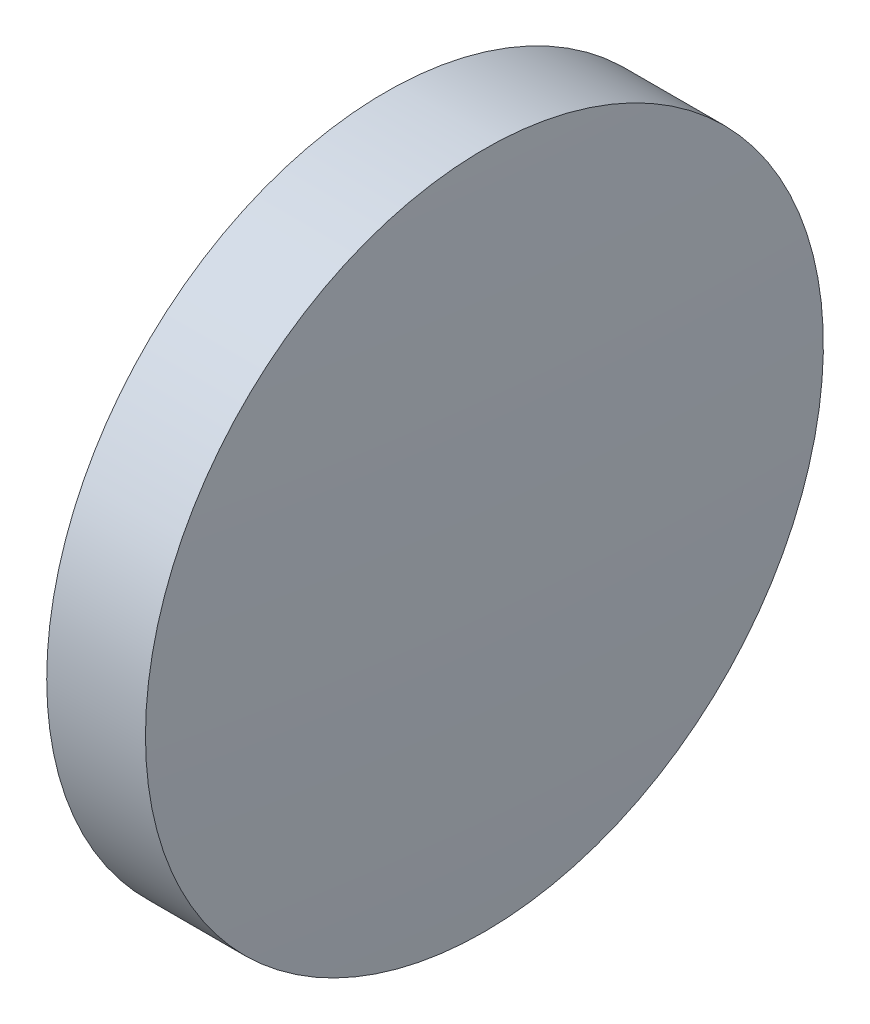
ISO-10303-21;
HEADER;
FILE_DESCRIPTION(('STEP AP214'),'2;1');
FILE_NAME('part.step','',(''),(''),'','','');
FILE_SCHEMA(('AUTOMOTIVE_DESIGN { 1 0 10303 214 1 1 1 1 }'));
ENDSEC;
DATA;
#1=APPLICATION_CONTEXT('core data for automotive mechanical design processes');
#2=APPLICATION_PROTOCOL_DEFINITION('international standard','automotive_design',2000,#1);
#3=PRODUCT_CONTEXT('',#1,'mechanical');
#4=PRODUCT('Part','Part','',(#3));
#5=PRODUCT_RELATED_PRODUCT_CATEGORY('part','',(#4));
#6=PRODUCT_DEFINITION_FORMATION('','',#4);
#7=PRODUCT_DEFINITION_CONTEXT('part definition',#1,'design');
#8=PRODUCT_DEFINITION('design','',#6,#7);
#9=PRODUCT_DEFINITION_SHAPE('','',#8);
#10=(LENGTH_UNIT() NAMED_UNIT(*) SI_UNIT(.MILLI.,.METRE.));
#11=(NAMED_UNIT(*) PLANE_ANGLE_UNIT() SI_UNIT($,.RADIAN.));
#12=(NAMED_UNIT(*) SI_UNIT($,.STERADIAN.) SOLID_ANGLE_UNIT());
#13=UNCERTAINTY_MEASURE_WITH_UNIT(LENGTH_MEASURE(1.E-05),#10,'distance_accuracy_value','');
#14=(GEOMETRIC_REPRESENTATION_CONTEXT(3) GLOBAL_UNCERTAINTY_ASSIGNED_CONTEXT((#13)) GLOBAL_UNIT_ASSIGNED_CONTEXT((#10,
#11,#12)) REPRESENTATION_CONTEXT('',''));
#15=CARTESIAN_POINT('',(0.,0.,0.));
#16=DIRECTION('',(0.,0.,1.));
#17=DIRECTION('',(1.,0.,0.));
#18=AXIS2_PLACEMENT_3D('',#15,#16,#17);
#19=CARTESIAN_POINT('',(161.651184704769,74.7633794186552,0.));
#20=DIRECTION('',(-1.,0.,0.));
#21=DIRECTION('',(0.,-1.,0.));
#22=AXIS2_PLACEMENT_3D('',#19,#20,#21);
#23=SPHERICAL_SURFACE('',#22,268.966666666669);
#24=CARTESIAN_POINT('',(430.317851371438,74.7633794186551,0.));
#25=DIRECTION('',(-1.,0.,0.));
#26=DIRECTION('',(0.,0.,1.));
#27=AXIS2_PLACEMENT_3D('',#24,#25,#26);
#28=CIRCLE('',#27,12.7);
#29=CARTESIAN_POINT('',(430.317851371438,74.7633794186551,12.7));
#30=VERTEX_POINT('',#29);
#31=EDGE_CURVE('E10',#30,#30,#28,.T.);
#32=ORIENTED_EDGE('',*,*,#31,.F.);
#33=EDGE_LOOP('',(#32));
#34=FACE_BOUND('',#33,.T.);
#35=ADVANCED_FACE('F35',(#34),#23,.T.);
#36=CARTESIAN_POINT('',(420.879633335762,74.7633794186551,0.));
#37=DIRECTION('',(-1.,0.,0.));
#38=DIRECTION('',(0.,0.,1.));
#39=AXIS2_PLACEMENT_3D('',#36,#37,#38);
#40=CYLINDRICAL_SURFACE('',#39,12.7);
#41=CARTESIAN_POINT('',(426.617851371438,74.7633794186551,0.));
#42=DIRECTION('',(-1.,0.,0.));
#43=DIRECTION('',(0.,0.,1.));
#44=AXIS2_PLACEMENT_3D('',#41,#42,#43);
#45=CIRCLE('',#44,12.7);
#46=CARTESIAN_POINT('',(426.617851371438,74.7633794186551,12.7));
#47=VERTEX_POINT('',#46);
#48=EDGE_CURVE('E41',#47,#47,#45,.T.);
#49=ORIENTED_EDGE('',*,*,#48,.F.);
#50=EDGE_LOOP('',(#49));
#51=FACE_BOUND('',#50,.T.);
#52=ORIENTED_EDGE('',*,*,#31,.T.);
#53=EDGE_LOOP('',(#52));
#54=FACE_BOUND('',#53,.T.);
#55=ADVANCED_FACE('F49',(#51,#54),#40,.T.);
#56=CARTESIAN_POINT('',(426.617851371438,74.7633794186551,0.));
#57=DIRECTION('',(1.,0.,0.));
#58=DIRECTION('',(0.,0.,-1.));
#59=AXIS2_PLACEMENT_3D('',#56,#57,#58);
#60=PLANE('',#59);
#61=ORIENTED_EDGE('',*,*,#48,.T.);
#62=EDGE_LOOP('',(#61));
#63=FACE_BOUND('',#62,.T.);
#64=ADVANCED_FACE('F47',(#63),#60,.F.);
#65=CLOSED_SHELL('',(#35,#55,#64));
#66=MANIFOLD_SOLID_BREP('B2',#65);
#67=ADVANCED_BREP_SHAPE_REPRESENTATION('',(#18,#66),#14);
#68=SHAPE_DEFINITION_REPRESENTATION(#9,#67);
ENDSEC;
END-ISO-10303-21;
